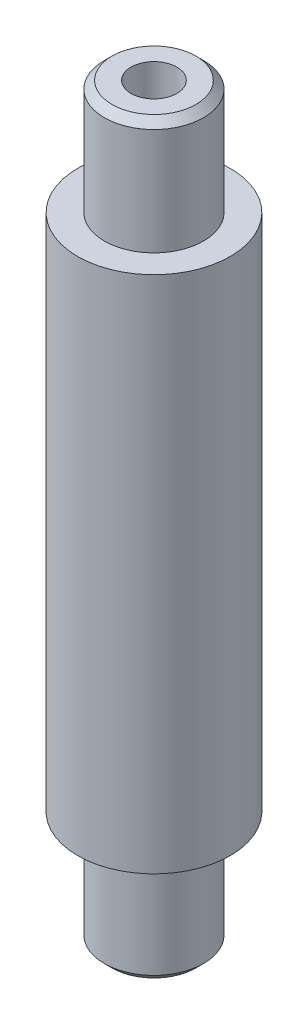
ISO-10303-21;
HEADER;
FILE_DESCRIPTION(('STEP AP214'),'2;1');
FILE_NAME('part.step','',(''),(''),'','','');
FILE_SCHEMA(('AUTOMOTIVE_DESIGN { 1 0 10303 214 1 1 1 1 }'));
ENDSEC;
DATA;
#1=APPLICATION_CONTEXT('core data for automotive mechanical design processes');
#2=APPLICATION_PROTOCOL_DEFINITION('international standard','automotive_design',2000,#1);
#3=PRODUCT_CONTEXT('',#1,'mechanical');
#4=PRODUCT('Part','Part','',(#3));
#5=PRODUCT_RELATED_PRODUCT_CATEGORY('part','',(#4));
#6=PRODUCT_DEFINITION_FORMATION('','',#4);
#7=PRODUCT_DEFINITION_CONTEXT('part definition',#1,'design');
#8=PRODUCT_DEFINITION('design','',#6,#7);
#9=PRODUCT_DEFINITION_SHAPE('','',#8);
#10=(LENGTH_UNIT() NAMED_UNIT(*) SI_UNIT(.MILLI.,.METRE.));
#11=(NAMED_UNIT(*) PLANE_ANGLE_UNIT() SI_UNIT($,.RADIAN.));
#12=(NAMED_UNIT(*) SI_UNIT($,.STERADIAN.) SOLID_ANGLE_UNIT());
#13=UNCERTAINTY_MEASURE_WITH_UNIT(LENGTH_MEASURE(1.E-05),#10,'distance_accuracy_value','');
#14=(GEOMETRIC_REPRESENTATION_CONTEXT(3) GLOBAL_UNCERTAINTY_ASSIGNED_CONTEXT((#13)) GLOBAL_UNIT_ASSIGNED_CONTEXT((#10,
#11,#12)) REPRESENTATION_CONTEXT('',''));
#15=CARTESIAN_POINT('',(0.,0.,0.));
#16=DIRECTION('',(0.,0.,1.));
#17=DIRECTION('',(1.,0.,0.));
#18=AXIS2_PLACEMENT_3D('',#15,#16,#17);
#19=CARTESIAN_POINT('',(0.,34.,0.));
#20=DIRECTION('',(0.,-1.,0.));
#21=DIRECTION('',(0.,0.,-1.));
#22=AXIS2_PLACEMENT_3D('',#19,#20,#21);
#23=CYLINDRICAL_SURFACE('',#22,10.);
#24=CARTESIAN_POINT('',(0.,34.,0.));
#25=DIRECTION('',(0.,1.,0.));
#26=DIRECTION('',(0.,0.,1.));
#27=AXIS2_PLACEMENT_3D('',#24,#25,#26);
#28=CIRCLE('',#27,10.);
#29=CARTESIAN_POINT('',(0.,34.,10.));
#30=VERTEX_POINT('',#29);
#31=EDGE_CURVE('E84',#30,#30,#28,.T.);
#32=ORIENTED_EDGE('',*,*,#31,.F.);
#33=EDGE_LOOP('',(#32));
#34=FACE_BOUND('',#33,.T.);
#35=CARTESIAN_POINT('',(0.,-34.,0.));
#36=DIRECTION('',(0.,1.,0.));
#37=DIRECTION('',(0.,0.,1.));
#38=AXIS2_PLACEMENT_3D('',#35,#36,#37);
#39=CIRCLE('',#38,10.);
#40=CARTESIAN_POINT('',(0.,-34.,10.));
#41=VERTEX_POINT('',#40);
#42=EDGE_CURVE('E85',#41,#41,#39,.T.);
#43=ORIENTED_EDGE('',*,*,#42,.T.);
#44=EDGE_LOOP('',(#43));
#45=FACE_BOUND('',#44,.T.);
#46=ADVANCED_FACE('F40',(#34,#45),#23,.T.);
#47=CARTESIAN_POINT('',(0.,34.,0.));
#48=DIRECTION('',(0.,1.,0.));
#49=DIRECTION('',(0.,0.,1.));
#50=AXIS2_PLACEMENT_3D('',#47,#48,#49);
#51=PLANE('',#50);
#52=CARTESIAN_POINT('',(0.,34.,0.));
#53=DIRECTION('',(0.,1.,0.));
#54=DIRECTION('',(0.,0.,1.));
#55=AXIS2_PLACEMENT_3D('',#52,#53,#54);
#56=CIRCLE('',#55,6.5);
#57=CARTESIAN_POINT('',(0.,34.,6.5));
#58=VERTEX_POINT('',#57);
#59=EDGE_CURVE('E89',#58,#58,#56,.F.);
#60=ORIENTED_EDGE('',*,*,#59,.T.);
#61=EDGE_LOOP('',(#60));
#62=FACE_BOUND('',#61,.T.);
#63=ORIENTED_EDGE('',*,*,#31,.T.);
#64=EDGE_LOOP('',(#63));
#65=FACE_BOUND('',#64,.T.);
#66=ADVANCED_FACE('F123',(#62,#65),#51,.T.);
#67=CARTESIAN_POINT('',(0.,-34.,0.));
#68=DIRECTION('',(0.,1.,0.));
#69=DIRECTION('',(0.,0.,1.));
#70=AXIS2_PLACEMENT_3D('',#67,#68,#69);
#71=PLANE('',#70);
#72=CARTESIAN_POINT('',(0.,-34.,0.));
#73=DIRECTION('',(0.,1.,0.));
#74=DIRECTION('',(0.,0.,1.));
#75=AXIS2_PLACEMENT_3D('',#72,#73,#74);
#76=CIRCLE('',#75,6.5);
#77=CARTESIAN_POINT('',(0.,-34.,6.5));
#78=VERTEX_POINT('',#77);
#79=EDGE_CURVE('E80',#78,#78,#76,.F.);
#80=ORIENTED_EDGE('',*,*,#79,.F.);
#81=EDGE_LOOP('',(#80));
#82=FACE_BOUND('',#81,.T.);
#83=ORIENTED_EDGE('',*,*,#42,.F.);
#84=EDGE_LOOP('',(#83));
#85=FACE_BOUND('',#84,.T.);
#86=ADVANCED_FACE('F129',(#82,#85),#71,.F.);
#87=CARTESIAN_POINT('',(0.,-49.,0.));
#88=DIRECTION('',(0.,1.,0.));
#89=DIRECTION('',(0.,0.,1.));
#90=AXIS2_PLACEMENT_3D('',#87,#88,#89);
#91=PLANE('',#90);
#92=CARTESIAN_POINT('',(0.,-49.,0.));
#93=DIRECTION('',(0.,1.,0.));
#94=DIRECTION('',(0.,0.,1.));
#95=AXIS2_PLACEMENT_3D('',#92,#93,#94);
#96=CIRCLE('',#95,3.);
#97=CARTESIAN_POINT('',(0.,-49.,3.));
#98=VERTEX_POINT('',#97);
#99=EDGE_CURVE('E100',#98,#98,#96,.T.);
#100=ORIENTED_EDGE('',*,*,#99,.T.);
#101=EDGE_LOOP('',(#100));
#102=FACE_BOUND('',#101,.T.);
#103=CARTESIAN_POINT('',(0.,-49.,0.));
#104=DIRECTION('',(0.,1.,0.));
#105=DIRECTION('',(0.,0.,1.));
#106=AXIS2_PLACEMENT_3D('',#103,#104,#105);
#107=CIRCLE('',#106,5.50000000000002);
#108=CARTESIAN_POINT('',(0.,-49.,5.50000000000002));
#109=VERTEX_POINT('',#108);
#110=EDGE_CURVE('E72',#109,#109,#107,.F.);
#111=ORIENTED_EDGE('',*,*,#110,.T.);
#112=EDGE_LOOP('',(#111));
#113=FACE_BOUND('',#112,.T.);
#114=ADVANCED_FACE('F105',(#102,#113),#91,.F.);
#115=CARTESIAN_POINT('',(0.,49.,0.));
#116=DIRECTION('',(0.,-1.,0.));
#117=DIRECTION('',(0.,0.,-1.));
#118=AXIS2_PLACEMENT_3D('',#115,#116,#117);
#119=CYLINDRICAL_SURFACE('',#118,6.5);
#120=CARTESIAN_POINT('',(0.,-48.,0.));
#121=DIRECTION('',(0.,1.,0.));
#122=DIRECTION('',(0.,0.,1.));
#123=AXIS2_PLACEMENT_3D('',#120,#121,#122);
#124=CIRCLE('',#123,6.5);
#125=CARTESIAN_POINT('',(0.,-48.,6.5));
#126=VERTEX_POINT('',#125);
#127=EDGE_CURVE('E76',#126,#126,#124,.T.);
#128=ORIENTED_EDGE('',*,*,#127,.T.);
#129=EDGE_LOOP('',(#128));
#130=FACE_BOUND('',#129,.T.);
#131=ORIENTED_EDGE('',*,*,#79,.T.);
#132=EDGE_LOOP('',(#131));
#133=FACE_BOUND('',#132,.T.);
#134=ADVANCED_FACE('F168',(#130,#133),#119,.T.);
#135=CARTESIAN_POINT('',(0.,48.,0.));
#136=DIRECTION('',(0.,1.,0.));
#137=DIRECTION('',(0.,0.,1.));
#138=AXIS2_PLACEMENT_3D('',#135,#136,#137);
#139=CIRCLE('',#138,6.5);
#140=CARTESIAN_POINT('',(0.,48.,6.5));
#141=VERTEX_POINT('',#140);
#142=EDGE_CURVE('E64',#141,#141,#139,.F.);
#143=ORIENTED_EDGE('',*,*,#142,.T.);
#144=EDGE_LOOP('',(#143));
#145=FACE_BOUND('',#144,.T.);
#146=ORIENTED_EDGE('',*,*,#59,.F.);
#147=EDGE_LOOP('',(#146));
#148=FACE_BOUND('',#147,.T.);
#149=ADVANCED_FACE('F161',(#145,#148),#119,.T.);
#150=CARTESIAN_POINT('',(0.,49.,0.));
#151=DIRECTION('',(0.,1.,0.));
#152=DIRECTION('',(0.,0.,1.));
#153=AXIS2_PLACEMENT_3D('',#150,#151,#152);
#154=PLANE('',#153);
#155=CARTESIAN_POINT('',(0.,49.,0.));
#156=DIRECTION('',(0.,1.,0.));
#157=DIRECTION('',(0.,0.,1.));
#158=AXIS2_PLACEMENT_3D('',#155,#156,#157);
#159=CIRCLE('',#158,3.);
#160=CARTESIAN_POINT('',(0.,49.,3.));
#161=VERTEX_POINT('',#160);
#162=EDGE_CURVE('E96',#161,#161,#159,.T.);
#163=ORIENTED_EDGE('',*,*,#162,.F.);
#164=EDGE_LOOP('',(#163));
#165=FACE_BOUND('',#164,.T.);
#166=CARTESIAN_POINT('',(0.,49.,0.));
#167=DIRECTION('',(0.,1.,0.));
#168=DIRECTION('',(0.,0.,1.));
#169=AXIS2_PLACEMENT_3D('',#166,#167,#168);
#170=CIRCLE('',#169,5.49999999999998);
#171=CARTESIAN_POINT('',(0.,49.,5.49999999999998));
#172=VERTEX_POINT('',#171);
#173=EDGE_CURVE('E68',#172,#172,#170,.T.);
#174=ORIENTED_EDGE('',*,*,#173,.T.);
#175=EDGE_LOOP('',(#174));
#176=FACE_BOUND('',#175,.T.);
#177=ADVANCED_FACE('F140',(#165,#176),#154,.T.);
#178=CARTESIAN_POINT('',(0.,-48.,0.));
#179=DIRECTION('',(0.,1.,0.));
#180=DIRECTION('',(0.,0.,1.));
#181=AXIS2_PLACEMENT_3D('',#178,#179,#180);
#182=CONICAL_SURFACE('',#181,6.5,0.785398163397452);
#183=ORIENTED_EDGE('',*,*,#110,.F.);
#184=EDGE_LOOP('',(#183));
#185=FACE_BOUND('',#184,.T.);
#186=ORIENTED_EDGE('',*,*,#127,.F.);
#187=EDGE_LOOP('',(#186));
#188=FACE_BOUND('',#187,.T.);
#189=ADVANCED_FACE('F136',(#185,#188),#182,.T.);
#190=CARTESIAN_POINT('',(0.,49.,0.));
#191=DIRECTION('',(0.,-1.,0.));
#192=DIRECTION('',(0.,0.,-1.));
#193=AXIS2_PLACEMENT_3D('',#190,#191,#192);
#194=CONICAL_SURFACE('',#193,5.49999999999998,0.785398163397453);
#195=ORIENTED_EDGE('',*,*,#142,.F.);
#196=EDGE_LOOP('',(#195));
#197=FACE_BOUND('',#196,.T.);
#198=ORIENTED_EDGE('',*,*,#173,.F.);
#199=EDGE_LOOP('',(#198));
#200=FACE_BOUND('',#199,.T.);
#201=ADVANCED_FACE('F139',(#197,#200),#194,.T.);
#202=CARTESIAN_POINT('',(0.,35.,0.));
#203=DIRECTION('',(0.,1.,0.));
#204=DIRECTION('',(0.,0.,1.));
#205=AXIS2_PLACEMENT_3D('',#202,#203,#204);
#206=CYLINDRICAL_SURFACE('',#205,3.);
#207=CARTESIAN_POINT('',(0.,36.,0.));
#208=DIRECTION('',(0.,1.,0.));
#209=DIRECTION('',(0.,0.,1.));
#210=AXIS2_PLACEMENT_3D('',#207,#208,#209);
#211=CIRCLE('',#210,3.);
#212=CARTESIAN_POINT('',(0.,36.,3.));
#213=VERTEX_POINT('',#212);
#214=EDGE_CURVE('E53',#213,#213,#211,.F.);
#215=ORIENTED_EDGE('',*,*,#214,.T.);
#216=EDGE_LOOP('',(#215));
#217=FACE_BOUND('',#216,.T.);
#218=ORIENTED_EDGE('',*,*,#162,.T.);
#219=EDGE_LOOP('',(#218));
#220=FACE_BOUND('',#219,.T.);
#221=ADVANCED_FACE('F119',(#217,#220),#206,.F.);
#222=CARTESIAN_POINT('',(0.,35.,0.));
#223=DIRECTION('',(0.,1.,0.));
#224=DIRECTION('',(0.,0.,1.));
#225=AXIS2_PLACEMENT_3D('',#222,#223,#224);
#226=PLANE('',#225);
#227=CARTESIAN_POINT('',(0.,35.,0.));
#228=DIRECTION('',(0.,1.,0.));
#229=DIRECTION('',(0.,0.,1.));
#230=AXIS2_PLACEMENT_3D('',#227,#228,#229);
#231=CIRCLE('',#230,1.99999999999997);
#232=CARTESIAN_POINT('',(0.,35.,1.99999999999997));
#233=VERTEX_POINT('',#232);
#234=EDGE_CURVE('E58',#233,#233,#231,.T.);
#235=ORIENTED_EDGE('',*,*,#234,.T.);
#236=EDGE_LOOP('',(#235));
#237=FACE_BOUND('',#236,.T.);
#238=ADVANCED_FACE('F111',(#237),#226,.T.);
#239=CARTESIAN_POINT('',(0.,-35.,0.));
#240=DIRECTION('',(0.,-1.,0.));
#241=DIRECTION('',(0.,0.,-1.));
#242=AXIS2_PLACEMENT_3D('',#239,#240,#241);
#243=CYLINDRICAL_SURFACE('',#242,3.);
#244=CARTESIAN_POINT('',(0.,-36.,0.));
#245=DIRECTION('',(0.,-1.,0.));
#246=DIRECTION('',(0.,0.,-1.));
#247=AXIS2_PLACEMENT_3D('',#244,#245,#246);
#248=CIRCLE('',#247,3.);
#249=CARTESIAN_POINT('',(0.,-36.,-3.));
#250=VERTEX_POINT('',#249);
#251=EDGE_CURVE('E48',#250,#250,#248,.F.);
#252=ORIENTED_EDGE('',*,*,#251,.T.);
#253=EDGE_LOOP('',(#252));
#254=FACE_BOUND('',#253,.T.);
#255=ORIENTED_EDGE('',*,*,#99,.F.);
#256=EDGE_LOOP('',(#255));
#257=FACE_BOUND('',#256,.T.);
#258=ADVANCED_FACE('F108',(#254,#257),#243,.F.);
#259=CARTESIAN_POINT('',(0.,-35.,0.));
#260=DIRECTION('',(0.,-1.,0.));
#261=DIRECTION('',(0.,0.,1.));
#262=AXIS2_PLACEMENT_3D('',#259,#260,#261);
#263=PLANE('',#262);
#264=CARTESIAN_POINT('',(0.,-35.,0.));
#265=DIRECTION('',(0.,-1.,0.));
#266=DIRECTION('',(0.,0.,-1.));
#267=AXIS2_PLACEMENT_3D('',#264,#265,#266);
#268=CIRCLE('',#267,1.99999999999997);
#269=CARTESIAN_POINT('',(0.,-35.,-1.99999999999997));
#270=VERTEX_POINT('',#269);
#271=EDGE_CURVE('E10',#270,#270,#268,.T.);
#272=ORIENTED_EDGE('',*,*,#271,.T.);
#273=EDGE_LOOP('',(#272));
#274=FACE_BOUND('',#273,.T.);
#275=ADVANCED_FACE('F110',(#274),#263,.T.);
#276=CARTESIAN_POINT('',(0.,35.,0.));
#277=DIRECTION('',(0.,1.,0.));
#278=DIRECTION('',(0.,0.,1.));
#279=AXIS2_PLACEMENT_3D('',#276,#277,#278);
#280=CONICAL_SURFACE('',#279,1.99999999999997,0.785398163397458);
#281=ORIENTED_EDGE('',*,*,#214,.F.);
#282=EDGE_LOOP('',(#281));
#283=FACE_BOUND('',#282,.T.);
#284=ORIENTED_EDGE('',*,*,#234,.F.);
#285=EDGE_LOOP('',(#284));
#286=FACE_BOUND('',#285,.T.);
#287=ADVANCED_FACE('F117',(#283,#286),#280,.F.);
#288=CARTESIAN_POINT('',(0.,-36.,0.));
#289=DIRECTION('',(0.,-1.,0.));
#290=DIRECTION('',(0.,0.,-1.));
#291=AXIS2_PLACEMENT_3D('',#288,#289,#290);
#292=CONICAL_SURFACE('',#291,3.,0.785398163397444);
#293=ORIENTED_EDGE('',*,*,#271,.F.);
#294=EDGE_LOOP('',(#293));
#295=FACE_BOUND('',#294,.T.);
#296=ORIENTED_EDGE('',*,*,#251,.F.);
#297=EDGE_LOOP('',(#296));
#298=FACE_BOUND('',#297,.T.);
#299=ADVANCED_FACE('F42',(#295,#298),#292,.F.);
#300=CLOSED_SHELL('',(#46,#66,#86,#114,#134,#149,#177,#189,#201,#221,#238,#258,#275,#287,#299));
#301=MANIFOLD_SOLID_BREP('B2',#300);
#302=ADVANCED_BREP_SHAPE_REPRESENTATION('',(#18,#301),#14);
#303=SHAPE_DEFINITION_REPRESENTATION(#9,#302);
ENDSEC;
END-ISO-10303-21;
